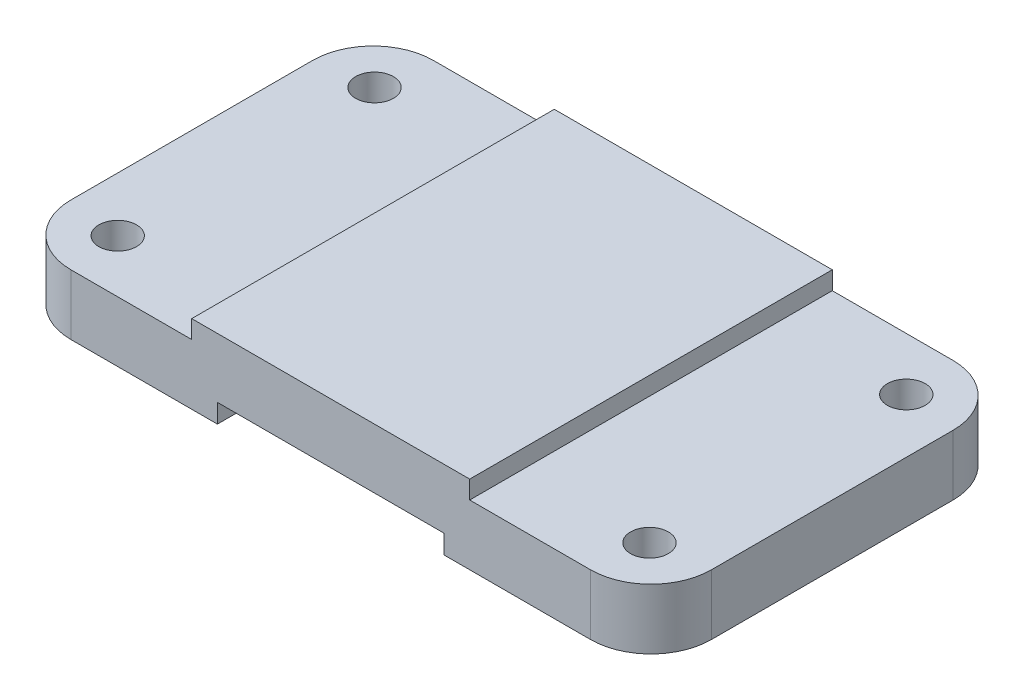
ISO-10303-21;
HEADER;
FILE_DESCRIPTION(('STEP AP214'),'2;1');
FILE_NAME('part.step','',(''),(''),'','','');
FILE_SCHEMA(('AUTOMOTIVE_DESIGN { 1 0 10303 214 1 1 1 1 }'));
ENDSEC;
DATA;
#1=APPLICATION_CONTEXT('core data for automotive mechanical design processes');
#2=APPLICATION_PROTOCOL_DEFINITION('international standard','automotive_design',2000,#1);
#3=PRODUCT_CONTEXT('',#1,'mechanical');
#4=PRODUCT('Part','Part','',(#3));
#5=PRODUCT_RELATED_PRODUCT_CATEGORY('part','',(#4));
#6=PRODUCT_DEFINITION_FORMATION('','',#4);
#7=PRODUCT_DEFINITION_CONTEXT('part definition',#1,'design');
#8=PRODUCT_DEFINITION('design','',#6,#7);
#9=PRODUCT_DEFINITION_SHAPE('','',#8);
#10=(LENGTH_UNIT() NAMED_UNIT(*) SI_UNIT(.MILLI.,.METRE.));
#11=(NAMED_UNIT(*) PLANE_ANGLE_UNIT() SI_UNIT($,.RADIAN.));
#12=(NAMED_UNIT(*) SI_UNIT($,.STERADIAN.) SOLID_ANGLE_UNIT());
#13=UNCERTAINTY_MEASURE_WITH_UNIT(LENGTH_MEASURE(1.E-05),#10,'distance_accuracy_value','');
#14=(GEOMETRIC_REPRESENTATION_CONTEXT(3) GLOBAL_UNCERTAINTY_ASSIGNED_CONTEXT((#13)) GLOBAL_UNIT_ASSIGNED_CONTEXT((#10,
#11,#12)) REPRESENTATION_CONTEXT('',''));
#15=CARTESIAN_POINT('',(0.,0.,0.));
#16=DIRECTION('',(0.,0.,1.));
#17=DIRECTION('',(1.,0.,0.));
#18=AXIS2_PLACEMENT_3D('',#15,#16,#17);
#19=CARTESIAN_POINT('',(12.7,-12.7,-63.5));
#20=DIRECTION('',(0.,1.,0.));
#21=DIRECTION('',(0.,0.,1.));
#22=AXIS2_PLACEMENT_3D('',#19,#20,#21);
#23=PLANE('',#22);
#24=CARTESIAN_POINT('',(11.43,-12.7,-65.0875));
#25=DIRECTION('',(0.,1.,0.));
#26=DIRECTION('',(0.,0.,1.));
#27=AXIS2_PLACEMENT_3D('',#24,#25,#26);
#28=CIRCLE('',#27,3.96875);
#29=CARTESIAN_POINT('',(11.43,-12.7,-61.11875));
#30=VERTEX_POINT('',#29);
#31=EDGE_CURVE('E232',#30,#30,#28,.T.);
#32=ORIENTED_EDGE('',*,*,#31,.T.);
#33=EDGE_LOOP('',(#32));
#34=FACE_BOUND('',#33,.T.);
#35=CARTESIAN_POINT('',(11.43,-12.7,-11.1125));
#36=DIRECTION('',(0.,1.,0.));
#37=DIRECTION('',(0.,0.,1.));
#38=AXIS2_PLACEMENT_3D('',#35,#36,#37);
#39=CIRCLE('',#38,3.96875);
#40=CARTESIAN_POINT('',(11.43,-12.7,-7.14374999999999));
#41=VERTEX_POINT('',#40);
#42=EDGE_CURVE('E214',#41,#41,#39,.T.);
#43=ORIENTED_EDGE('',*,*,#42,.T.);
#44=EDGE_LOOP('',(#43));
#45=FACE_BOUND('',#44,.T.);
#46=DIRECTION('',(-1.,0.,0.));
#47=VECTOR('',#46,1.);
#48=CARTESIAN_POINT('',(12.7000000000001,-12.7,-76.2));
#49=LINE('',#48,#47);
#50=CARTESIAN_POINT('',(43.4975,-12.7,-76.2));
#51=VERTEX_POINT('',#50);
#52=CARTESIAN_POINT('',(12.7000000000001,-12.7,-76.2));
#53=VERTEX_POINT('',#52);
#54=EDGE_CURVE('E261',#51,#53,#49,.T.);
#55=ORIENTED_EDGE('',*,*,#54,.F.);
#56=DIRECTION('',(0.,0.,-1.));
#57=VECTOR('',#56,1.);
#58=CARTESIAN_POINT('',(43.4975,-12.7,0.));
#59=LINE('',#58,#57);
#60=CARTESIAN_POINT('',(43.4975,-12.7,0.));
#61=VERTEX_POINT('',#60);
#62=EDGE_CURVE('E158',#61,#51,#59,.T.);
#63=ORIENTED_EDGE('',*,*,#62,.F.);
#64=DIRECTION('',(1.,0.,0.));
#65=VECTOR('',#64,1.);
#66=CARTESIAN_POINT('',(12.7000000000001,-12.7,0.));
#67=LINE('',#66,#65);
#68=CARTESIAN_POINT('',(12.7000000000001,-12.7,0.));
#69=VERTEX_POINT('',#68);
#70=EDGE_CURVE('E249',#69,#61,#67,.T.);
#71=ORIENTED_EDGE('',*,*,#70,.F.);
#72=CARTESIAN_POINT('',(12.7,-12.7,-12.7));
#73=DIRECTION('',(0.,1.,0.));
#74=DIRECTION('',(0.,0.,1.));
#75=AXIS2_PLACEMENT_3D('',#72,#73,#74);
#76=CIRCLE('',#75,12.7);
#77=CARTESIAN_POINT('',(0.,-12.7,-12.7000000000001));
#78=VERTEX_POINT('',#77);
#79=EDGE_CURVE('E245',#78,#69,#76,.T.);
#80=ORIENTED_EDGE('',*,*,#79,.F.);
#81=DIRECTION('',(0.,0.,1.));
#82=VECTOR('',#81,1.);
#83=CARTESIAN_POINT('',(0.,-12.7,-63.4999999999999));
#84=LINE('',#83,#82);
#85=CARTESIAN_POINT('',(0.,-12.7,-63.4999999999999));
#86=VERTEX_POINT('',#85);
#87=EDGE_CURVE('E241',#86,#78,#84,.T.);
#88=ORIENTED_EDGE('',*,*,#87,.F.);
#89=CARTESIAN_POINT('',(12.7,-12.7,-63.5));
#90=DIRECTION('',(0.,1.,0.));
#91=DIRECTION('',(0.,0.,1.));
#92=AXIS2_PLACEMENT_3D('',#89,#90,#91);
#93=CIRCLE('',#92,12.7);
#94=EDGE_CURVE('E238',#53,#86,#93,.T.);
#95=ORIENTED_EDGE('',*,*,#94,.F.);
#96=EDGE_LOOP('',(#55,#63,#71,#80,#88,#95));
#97=FACE_BOUND('',#96,.T.);
#98=ADVANCED_FACE('F38',(#34,#45,#97),#23,.F.);
#99=CARTESIAN_POINT('',(12.7,0.,-63.5));
#100=DIRECTION('',(0.,1.,0.));
#101=DIRECTION('',(0.,0.,1.));
#102=AXIS2_PLACEMENT_3D('',#99,#100,#101);
#103=PLANE('',#102);
#104=DIRECTION('',(0.,0.,1.));
#105=VECTOR('',#104,1.);
#106=CARTESIAN_POINT('',(38.1,0.,-76.2));
#107=LINE('',#106,#105);
#108=CARTESIAN_POINT('',(38.1,0.,-76.2));
#109=VERTEX_POINT('',#108);
#110=CARTESIAN_POINT('',(38.1,0.,0.));
#111=VERTEX_POINT('',#110);
#112=EDGE_CURVE('E63',#109,#111,#107,.T.);
#113=ORIENTED_EDGE('',*,*,#112,.F.);
#114=DIRECTION('',(-1.,0.,0.));
#115=VECTOR('',#114,1.);
#116=CARTESIAN_POINT('',(12.7000000000001,0.,-76.2));
#117=LINE('',#116,#115);
#118=CARTESIAN_POINT('',(12.7000000000001,0.,-76.2));
#119=VERTEX_POINT('',#118);
#120=EDGE_CURVE('E284',#109,#119,#117,.T.);
#121=ORIENTED_EDGE('',*,*,#120,.T.);
#122=CARTESIAN_POINT('',(12.7,0.,-63.5));
#123=DIRECTION('',(0.,1.,0.));
#124=DIRECTION('',(0.,0.,1.));
#125=AXIS2_PLACEMENT_3D('',#122,#123,#124);
#126=CIRCLE('',#125,12.7);
#127=CARTESIAN_POINT('',(0.,0.,-63.4999999999999));
#128=VERTEX_POINT('',#127);
#129=EDGE_CURVE('E235',#119,#128,#126,.T.);
#130=ORIENTED_EDGE('',*,*,#129,.T.);
#131=DIRECTION('',(0.,0.,1.));
#132=VECTOR('',#131,1.);
#133=CARTESIAN_POINT('',(0.,0.,-63.4999999999999));
#134=LINE('',#133,#132);
#135=CARTESIAN_POINT('',(0.,0.,-12.7000000000001));
#136=VERTEX_POINT('',#135);
#137=EDGE_CURVE('E266',#128,#136,#134,.T.);
#138=ORIENTED_EDGE('',*,*,#137,.T.);
#139=CARTESIAN_POINT('',(12.7,0.,-12.7));
#140=DIRECTION('',(0.,1.,0.));
#141=DIRECTION('',(0.,0.,1.));
#142=AXIS2_PLACEMENT_3D('',#139,#140,#141);
#143=CIRCLE('',#142,12.7);
#144=CARTESIAN_POINT('',(12.7000000000001,0.,0.));
#145=VERTEX_POINT('',#144);
#146=EDGE_CURVE('E269',#136,#145,#143,.T.);
#147=ORIENTED_EDGE('',*,*,#146,.T.);
#148=DIRECTION('',(1.,0.,0.));
#149=VECTOR('',#148,1.);
#150=CARTESIAN_POINT('',(12.7000000000001,0.,0.));
#151=LINE('',#150,#149);
#152=EDGE_CURVE('E273',#145,#111,#151,.T.);
#153=ORIENTED_EDGE('',*,*,#152,.T.);
#154=EDGE_LOOP('',(#113,#121,#130,#138,#147,#153));
#155=FACE_BOUND('',#154,.T.);
#156=CARTESIAN_POINT('',(11.43,0.,-65.0875));
#157=DIRECTION('',(0.,1.,0.));
#158=DIRECTION('',(0.,0.,1.));
#159=AXIS2_PLACEMENT_3D('',#156,#157,#158);
#160=CIRCLE('',#159,3.96875);
#161=CARTESIAN_POINT('',(11.43,0.,-61.11875));
#162=VERTEX_POINT('',#161);
#163=EDGE_CURVE('E229',#162,#162,#160,.T.);
#164=ORIENTED_EDGE('',*,*,#163,.F.);
#165=EDGE_LOOP('',(#164));
#166=FACE_BOUND('',#165,.T.);
#167=CARTESIAN_POINT('',(11.43,0.,-11.1125));
#168=DIRECTION('',(0.,1.,0.));
#169=DIRECTION('',(0.,0.,1.));
#170=AXIS2_PLACEMENT_3D('',#167,#168,#169);
#171=CIRCLE('',#170,3.96875);
#172=CARTESIAN_POINT('',(11.43,0.,-7.14374999999999));
#173=VERTEX_POINT('',#172);
#174=EDGE_CURVE('E213',#173,#173,#171,.T.);
#175=ORIENTED_EDGE('',*,*,#174,.F.);
#176=EDGE_LOOP('',(#175));
#177=FACE_BOUND('',#176,.T.);
#178=ADVANCED_FACE('F305',(#155,#166,#177),#103,.T.);
#179=CARTESIAN_POINT('',(12.7,-12.7,-63.5));
#180=DIRECTION('',(0.,1.,0.));
#181=DIRECTION('',(0.,0.,1.));
#182=AXIS2_PLACEMENT_3D('',#179,#180,#181);
#183=CYLINDRICAL_SURFACE('',#182,12.7);
#184=ORIENTED_EDGE('',*,*,#129,.F.);
#185=DIRECTION('',(0.,1.,0.));
#186=VECTOR('',#185,1.);
#187=CARTESIAN_POINT('',(12.7000000000001,-12.7,-76.2));
#188=LINE('',#187,#186);
#189=EDGE_CURVE('E11',#53,#119,#188,.T.);
#190=ORIENTED_EDGE('',*,*,#189,.F.);
#191=ORIENTED_EDGE('',*,*,#94,.T.);
#192=DIRECTION('',(0.,1.,0.));
#193=VECTOR('',#192,1.);
#194=CARTESIAN_POINT('',(0.,-12.7,-63.4999999999999));
#195=LINE('',#194,#193);
#196=EDGE_CURVE('E42',#86,#128,#195,.T.);
#197=ORIENTED_EDGE('',*,*,#196,.T.);
#198=EDGE_LOOP('',(#184,#190,#191,#197));
#199=FACE_BOUND('',#198,.T.);
#200=ADVANCED_FACE('F40',(#199),#183,.T.);
#201=CARTESIAN_POINT('',(12.7000000000001,-12.7,-76.2));
#202=DIRECTION('',(0.,0.,-1.));
#203=DIRECTION('',(-1.,0.,0.));
#204=AXIS2_PLACEMENT_3D('',#201,#202,#203);
#205=PLANE('',#204);
#206=DIRECTION('',(0.,-1.,0.));
#207=VECTOR('',#206,1.);
#208=CARTESIAN_POINT('',(43.4975,-8.7376,-76.2));
#209=LINE('',#208,#207);
#210=CARTESIAN_POINT('',(43.4975,-8.7376,-76.2));
#211=VERTEX_POINT('',#210);
#212=EDGE_CURVE('E152',#211,#51,#209,.T.);
#213=ORIENTED_EDGE('',*,*,#212,.T.);
#214=ORIENTED_EDGE('',*,*,#54,.T.);
#215=ORIENTED_EDGE('',*,*,#189,.T.);
#216=ORIENTED_EDGE('',*,*,#120,.F.);
#217=DIRECTION('',(0.,-1.,0.));
#218=VECTOR('',#217,1.);
#219=CARTESIAN_POINT('',(38.1,3.80999999999999,-76.2));
#220=LINE('',#219,#218);
#221=CARTESIAN_POINT('',(38.1,3.80999999999999,-76.2));
#222=VERTEX_POINT('',#221);
#223=EDGE_CURVE('E198',#222,#109,#220,.T.);
#224=ORIENTED_EDGE('',*,*,#223,.F.);
#225=DIRECTION('',(-1.,0.,0.));
#226=VECTOR('',#225,1.);
#227=CARTESIAN_POINT('',(38.1,3.80999999999999,-76.2));
#228=LINE('',#227,#226);
#229=CARTESIAN_POINT('',(96.52,3.80999999999999,-76.2));
#230=VERTEX_POINT('',#229);
#231=EDGE_CURVE('E196',#230,#222,#228,.T.);
#232=ORIENTED_EDGE('',*,*,#231,.F.);
#233=DIRECTION('',(0.,-1.,0.));
#234=VECTOR('',#233,1.);
#235=CARTESIAN_POINT('',(96.52,3.80999999999999,-76.2));
#236=LINE('',#235,#234);
#237=CARTESIAN_POINT('',(96.52,0.,-76.2));
#238=VERTEX_POINT('',#237);
#239=EDGE_CURVE('E204',#230,#238,#236,.T.);
#240=ORIENTED_EDGE('',*,*,#239,.T.);
#241=CARTESIAN_POINT('',(121.92,0.,-76.2));
#242=VERTEX_POINT('',#241);
#243=EDGE_CURVE('E242',#242,#238,#117,.T.);
#244=ORIENTED_EDGE('',*,*,#243,.F.);
#245=DIRECTION('',(0.,1.,0.));
#246=VECTOR('',#245,1.);
#247=CARTESIAN_POINT('',(121.92,-12.7,-76.2));
#248=LINE('',#247,#246);
#249=CARTESIAN_POINT('',(121.92,-12.7,-76.2));
#250=VERTEX_POINT('',#249);
#251=EDGE_CURVE('E47',#250,#242,#248,.T.);
#252=ORIENTED_EDGE('',*,*,#251,.F.);
#253=CARTESIAN_POINT('',(91.1225,-12.7,-76.2));
#254=VERTEX_POINT('',#253);
#255=EDGE_CURVE('E262',#250,#254,#49,.T.);
#256=ORIENTED_EDGE('',*,*,#255,.T.);
#257=DIRECTION('',(0.,-1.,0.));
#258=VECTOR('',#257,1.);
#259=CARTESIAN_POINT('',(91.1225,-8.7376,-76.2));
#260=LINE('',#259,#258);
#261=CARTESIAN_POINT('',(91.1225,-8.7376,-76.2));
#262=VERTEX_POINT('',#261);
#263=EDGE_CURVE('E55',#262,#254,#260,.T.);
#264=ORIENTED_EDGE('',*,*,#263,.F.);
#265=DIRECTION('',(1.,0.,0.));
#266=VECTOR('',#265,1.);
#267=CARTESIAN_POINT('',(43.4975,-8.7376,-76.2));
#268=LINE('',#267,#266);
#269=EDGE_CURVE('E168',#211,#262,#268,.T.);
#270=ORIENTED_EDGE('',*,*,#269,.F.);
#271=EDGE_LOOP('',(#213,#214,#215,#216,#224,#232,#240,#244,#252,#256,#264,#270));
#272=FACE_BOUND('',#271,.T.);
#273=ADVANCED_FACE('F173',(#272),#205,.T.);
#274=CARTESIAN_POINT('',(121.92,-12.7,-63.5));
#275=DIRECTION('',(0.,1.,0.));
#276=DIRECTION('',(0.,0.,1.));
#277=AXIS2_PLACEMENT_3D('',#274,#275,#276);
#278=CYLINDRICAL_SURFACE('',#277,12.7);
#279=CARTESIAN_POINT('',(121.92,0.,-63.5));
#280=DIRECTION('',(0.,1.,0.));
#281=DIRECTION('',(0.,0.,1.));
#282=AXIS2_PLACEMENT_3D('',#279,#280,#281);
#283=CIRCLE('',#282,12.7);
#284=CARTESIAN_POINT('',(134.62,0.,-63.4999999999999));
#285=VERTEX_POINT('',#284);
#286=EDGE_CURVE('E281',#285,#242,#283,.T.);
#287=ORIENTED_EDGE('',*,*,#286,.F.);
#288=DIRECTION('',(0.,1.,0.));
#289=VECTOR('',#288,1.);
#290=CARTESIAN_POINT('',(134.62,-12.7,-63.4999999999999));
#291=LINE('',#290,#289);
#292=CARTESIAN_POINT('',(134.62,-12.7,-63.4999999999999));
#293=VERTEX_POINT('',#292);
#294=EDGE_CURVE('E287',#293,#285,#291,.T.);
#295=ORIENTED_EDGE('',*,*,#294,.F.);
#296=CARTESIAN_POINT('',(121.92,-12.7,-63.5));
#297=DIRECTION('',(0.,1.,0.));
#298=DIRECTION('',(0.,0.,1.));
#299=AXIS2_PLACEMENT_3D('',#296,#297,#298);
#300=CIRCLE('',#299,12.7);
#301=EDGE_CURVE('E258',#293,#250,#300,.T.);
#302=ORIENTED_EDGE('',*,*,#301,.T.);
#303=ORIENTED_EDGE('',*,*,#251,.T.);
#304=EDGE_LOOP('',(#287,#295,#302,#303));
#305=FACE_BOUND('',#304,.T.);
#306=ADVANCED_FACE('F346',(#305),#278,.T.);
#307=CARTESIAN_POINT('',(134.62,-12.7,-63.4999999999999));
#308=DIRECTION('',(1.,0.,0.));
#309=DIRECTION('',(0.,0.,-1.));
#310=AXIS2_PLACEMENT_3D('',#307,#308,#309);
#311=PLANE('',#310);
#312=DIRECTION('',(0.,0.,-1.));
#313=VECTOR('',#312,1.);
#314=CARTESIAN_POINT('',(134.62,0.,-63.4999999999999));
#315=LINE('',#314,#313);
#316=CARTESIAN_POINT('',(134.62,0.,-12.7000000000001));
#317=VERTEX_POINT('',#316);
#318=EDGE_CURVE('E278',#317,#285,#315,.T.);
#319=ORIENTED_EDGE('',*,*,#318,.F.);
#320=DIRECTION('',(0.,1.,0.));
#321=VECTOR('',#320,1.);
#322=CARTESIAN_POINT('',(134.62,-12.7,-12.7000000000001));
#323=LINE('',#322,#321);
#324=CARTESIAN_POINT('',(134.62,-12.7,-12.7000000000001));
#325=VERTEX_POINT('',#324);
#326=EDGE_CURVE('E289',#325,#317,#323,.T.);
#327=ORIENTED_EDGE('',*,*,#326,.F.);
#328=DIRECTION('',(0.,0.,-1.));
#329=VECTOR('',#328,1.);
#330=CARTESIAN_POINT('',(134.62,-12.7,-63.4999999999999));
#331=LINE('',#330,#329);
#332=EDGE_CURVE('E255',#325,#293,#331,.T.);
#333=ORIENTED_EDGE('',*,*,#332,.T.);
#334=ORIENTED_EDGE('',*,*,#294,.T.);
#335=EDGE_LOOP('',(#319,#327,#333,#334));
#336=FACE_BOUND('',#335,.T.);
#337=ADVANCED_FACE('F342',(#336),#311,.T.);
#338=CARTESIAN_POINT('',(121.92,-12.7,-12.7));
#339=DIRECTION('',(0.,1.,0.));
#340=DIRECTION('',(0.,0.,1.));
#341=AXIS2_PLACEMENT_3D('',#338,#339,#340);
#342=CYLINDRICAL_SURFACE('',#341,12.7);
#343=CARTESIAN_POINT('',(121.92,0.,-12.7));
#344=DIRECTION('',(0.,1.,0.));
#345=DIRECTION('',(0.,0.,1.));
#346=AXIS2_PLACEMENT_3D('',#343,#344,#345);
#347=CIRCLE('',#346,12.7);
#348=CARTESIAN_POINT('',(121.92,0.,0.));
#349=VERTEX_POINT('',#348);
#350=EDGE_CURVE('E275',#349,#317,#347,.T.);
#351=ORIENTED_EDGE('',*,*,#350,.F.);
#352=DIRECTION('',(0.,1.,0.));
#353=VECTOR('',#352,1.);
#354=CARTESIAN_POINT('',(121.92,-12.7,0.));
#355=LINE('',#354,#353);
#356=CARTESIAN_POINT('',(121.92,-12.7,0.));
#357=VERTEX_POINT('',#356);
#358=EDGE_CURVE('E291',#357,#349,#355,.T.);
#359=ORIENTED_EDGE('',*,*,#358,.F.);
#360=CARTESIAN_POINT('',(121.92,-12.7,-12.7));
#361=DIRECTION('',(0.,1.,0.));
#362=DIRECTION('',(0.,0.,1.));
#363=AXIS2_PLACEMENT_3D('',#360,#361,#362);
#364=CIRCLE('',#363,12.7);
#365=EDGE_CURVE('E252',#357,#325,#364,.T.);
#366=ORIENTED_EDGE('',*,*,#365,.T.);
#367=ORIENTED_EDGE('',*,*,#326,.T.);
#368=EDGE_LOOP('',(#351,#359,#366,#367));
#369=FACE_BOUND('',#368,.T.);
#370=ADVANCED_FACE('F338',(#369),#342,.T.);
#371=CARTESIAN_POINT('',(12.7000000000001,-12.7,0.));
#372=DIRECTION('',(0.,0.,1.));
#373=DIRECTION('',(1.,0.,0.));
#374=AXIS2_PLACEMENT_3D('',#371,#372,#373);
#375=PLANE('',#374);
#376=DIRECTION('',(0.,-1.,0.));
#377=VECTOR('',#376,1.);
#378=CARTESIAN_POINT('',(43.4975,-8.7376,0.));
#379=LINE('',#378,#377);
#380=CARTESIAN_POINT('',(43.4975,-8.7376,0.));
#381=VERTEX_POINT('',#380);
#382=EDGE_CURVE('E182',#381,#61,#379,.T.);
#383=ORIENTED_EDGE('',*,*,#382,.F.);
#384=DIRECTION('',(-1.,0.,0.));
#385=VECTOR('',#384,1.);
#386=CARTESIAN_POINT('',(43.4975,-8.7376,0.));
#387=LINE('',#386,#385);
#388=CARTESIAN_POINT('',(91.1225,-8.7376,0.));
#389=VERTEX_POINT('',#388);
#390=EDGE_CURVE('E162',#389,#381,#387,.T.);
#391=ORIENTED_EDGE('',*,*,#390,.F.);
#392=DIRECTION('',(0.,-1.,0.));
#393=VECTOR('',#392,1.);
#394=CARTESIAN_POINT('',(91.1225,-8.7376,0.));
#395=LINE('',#394,#393);
#396=CARTESIAN_POINT('',(91.1225,-12.7,0.));
#397=VERTEX_POINT('',#396);
#398=EDGE_CURVE('E184',#389,#397,#395,.T.);
#399=ORIENTED_EDGE('',*,*,#398,.T.);
#400=EDGE_CURVE('E248',#397,#357,#67,.T.);
#401=ORIENTED_EDGE('',*,*,#400,.T.);
#402=ORIENTED_EDGE('',*,*,#358,.T.);
#403=CARTESIAN_POINT('',(96.52,0.,0.));
#404=VERTEX_POINT('',#403);
#405=EDGE_CURVE('E272',#404,#349,#151,.T.);
#406=ORIENTED_EDGE('',*,*,#405,.F.);
#407=DIRECTION('',(0.,-1.,0.));
#408=VECTOR('',#407,1.);
#409=CARTESIAN_POINT('',(96.52,3.80999999999999,0.));
#410=LINE('',#409,#408);
#411=CARTESIAN_POINT('',(96.52,3.80999999999999,0.));
#412=VERTEX_POINT('',#411);
#413=EDGE_CURVE('E207',#412,#404,#410,.T.);
#414=ORIENTED_EDGE('',*,*,#413,.F.);
#415=DIRECTION('',(1.,0.,0.));
#416=VECTOR('',#415,1.);
#417=CARTESIAN_POINT('',(38.1,3.80999999999999,0.));
#418=LINE('',#417,#416);
#419=CARTESIAN_POINT('',(38.1,3.80999999999999,0.));
#420=VERTEX_POINT('',#419);
#421=EDGE_CURVE('E191',#420,#412,#418,.T.);
#422=ORIENTED_EDGE('',*,*,#421,.F.);
#423=DIRECTION('',(0.,-1.,0.));
#424=VECTOR('',#423,1.);
#425=CARTESIAN_POINT('',(38.1,3.80999999999999,0.));
#426=LINE('',#425,#424);
#427=EDGE_CURVE('E210',#420,#111,#426,.T.);
#428=ORIENTED_EDGE('',*,*,#427,.T.);
#429=ORIENTED_EDGE('',*,*,#152,.F.);
#430=DIRECTION('',(0.,1.,0.));
#431=VECTOR('',#430,1.);
#432=CARTESIAN_POINT('',(12.7000000000001,-12.7,0.));
#433=LINE('',#432,#431);
#434=EDGE_CURVE('E294',#69,#145,#433,.T.);
#435=ORIENTED_EDGE('',*,*,#434,.F.);
#436=ORIENTED_EDGE('',*,*,#70,.T.);
#437=EDGE_LOOP('',(#383,#391,#399,#401,#402,#406,#414,#422,#428,#429,#435,#436));
#438=FACE_BOUND('',#437,.T.);
#439=ADVANCED_FACE('F316',(#438),#375,.T.);
#440=CARTESIAN_POINT('',(12.7,-12.7,-12.7));
#441=DIRECTION('',(0.,1.,0.));
#442=DIRECTION('',(0.,0.,1.));
#443=AXIS2_PLACEMENT_3D('',#440,#441,#442);
#444=CYLINDRICAL_SURFACE('',#443,12.7);
#445=ORIENTED_EDGE('',*,*,#146,.F.);
#446=DIRECTION('',(0.,1.,0.));
#447=VECTOR('',#446,1.);
#448=CARTESIAN_POINT('',(0.,-12.7,-12.7000000000001));
#449=LINE('',#448,#447);
#450=EDGE_CURVE('E295',#78,#136,#449,.T.);
#451=ORIENTED_EDGE('',*,*,#450,.F.);
#452=ORIENTED_EDGE('',*,*,#79,.T.);
#453=ORIENTED_EDGE('',*,*,#434,.T.);
#454=EDGE_LOOP('',(#445,#451,#452,#453));
#455=FACE_BOUND('',#454,.T.);
#456=ADVANCED_FACE('F312',(#455),#444,.T.);
#457=CARTESIAN_POINT('',(0.,-12.7,-63.4999999999999));
#458=DIRECTION('',(-1.,0.,0.));
#459=DIRECTION('',(0.,0.,1.));
#460=AXIS2_PLACEMENT_3D('',#457,#458,#459);
#461=PLANE('',#460);
#462=ORIENTED_EDGE('',*,*,#137,.F.);
#463=ORIENTED_EDGE('',*,*,#196,.F.);
#464=ORIENTED_EDGE('',*,*,#87,.T.);
#465=ORIENTED_EDGE('',*,*,#450,.T.);
#466=EDGE_LOOP('',(#462,#463,#464,#465));
#467=FACE_BOUND('',#466,.T.);
#468=ADVANCED_FACE('F304',(#467),#461,.T.);
#469=CARTESIAN_POINT('',(123.19,-12.7,-11.1125));
#470=DIRECTION('',(0.,1.,0.));
#471=DIRECTION('',(0.,0.,1.));
#472=AXIS2_PLACEMENT_3D('',#469,#470,#471);
#473=CIRCLE('',#472,3.96874999999995);
#474=CARTESIAN_POINT('',(123.19,-12.7,-7.14375000000006));
#475=VERTEX_POINT('',#474);
#476=EDGE_CURVE('E220',#475,#475,#473,.T.);
#477=ORIENTED_EDGE('',*,*,#476,.T.);
#478=EDGE_LOOP('',(#477));
#479=FACE_BOUND('',#478,.T.);
#480=CARTESIAN_POINT('',(123.19,-12.7,-65.0875));
#481=DIRECTION('',(0.,1.,0.));
#482=DIRECTION('',(0.,0.,1.));
#483=AXIS2_PLACEMENT_3D('',#480,#481,#482);
#484=CIRCLE('',#483,3.96874999999996);
#485=CARTESIAN_POINT('',(123.19,-12.7,-61.11875));
#486=VERTEX_POINT('',#485);
#487=EDGE_CURVE('E226',#486,#486,#484,.T.);
#488=ORIENTED_EDGE('',*,*,#487,.T.);
#489=EDGE_LOOP('',(#488));
#490=FACE_BOUND('',#489,.T.);
#491=ORIENTED_EDGE('',*,*,#400,.F.);
#492=DIRECTION('',(0.,0.,1.));
#493=VECTOR('',#492,1.);
#494=CARTESIAN_POINT('',(91.1225,-12.7,0.));
#495=LINE('',#494,#493);
#496=EDGE_CURVE('E171',#254,#397,#495,.T.);
#497=ORIENTED_EDGE('',*,*,#496,.F.);
#498=ORIENTED_EDGE('',*,*,#255,.F.);
#499=ORIENTED_EDGE('',*,*,#301,.F.);
#500=ORIENTED_EDGE('',*,*,#332,.F.);
#501=ORIENTED_EDGE('',*,*,#365,.F.);
#502=EDGE_LOOP('',(#491,#497,#498,#499,#500,#501));
#503=FACE_BOUND('',#502,.T.);
#504=ADVANCED_FACE('F349',(#479,#490,#503),#23,.F.);
#505=DIRECTION('',(0.,0.,-1.));
#506=VECTOR('',#505,1.);
#507=CARTESIAN_POINT('',(96.52,0.,-76.2));
#508=LINE('',#507,#506);
#509=EDGE_CURVE('E192',#404,#238,#508,.T.);
#510=ORIENTED_EDGE('',*,*,#509,.F.);
#511=ORIENTED_EDGE('',*,*,#405,.T.);
#512=ORIENTED_EDGE('',*,*,#350,.T.);
#513=ORIENTED_EDGE('',*,*,#318,.T.);
#514=ORIENTED_EDGE('',*,*,#286,.T.);
#515=ORIENTED_EDGE('',*,*,#243,.T.);
#516=EDGE_LOOP('',(#510,#511,#512,#513,#514,#515));
#517=FACE_BOUND('',#516,.T.);
#518=CARTESIAN_POINT('',(123.19,0.,-11.1125));
#519=DIRECTION('',(0.,1.,0.));
#520=DIRECTION('',(0.,0.,1.));
#521=AXIS2_PLACEMENT_3D('',#518,#519,#520);
#522=CIRCLE('',#521,3.96874999999995);
#523=CARTESIAN_POINT('',(123.19,0.,-7.14375000000006));
#524=VERTEX_POINT('',#523);
#525=EDGE_CURVE('E217',#524,#524,#522,.T.);
#526=ORIENTED_EDGE('',*,*,#525,.F.);
#527=EDGE_LOOP('',(#526));
#528=FACE_BOUND('',#527,.T.);
#529=CARTESIAN_POINT('',(123.19,0.,-65.0875));
#530=DIRECTION('',(0.,1.,0.));
#531=DIRECTION('',(0.,0.,1.));
#532=AXIS2_PLACEMENT_3D('',#529,#530,#531);
#533=CIRCLE('',#532,3.96874999999996);
#534=CARTESIAN_POINT('',(123.19,0.,-61.11875));
#535=VERTEX_POINT('',#534);
#536=EDGE_CURVE('E223',#535,#535,#533,.T.);
#537=ORIENTED_EDGE('',*,*,#536,.F.);
#538=EDGE_LOOP('',(#537));
#539=FACE_BOUND('',#538,.T.);
#540=ADVANCED_FACE('F331',(#517,#528,#539),#103,.T.);
#541=CARTESIAN_POINT('',(11.43,-12.7,-65.0875));
#542=DIRECTION('',(0.,1.,0.));
#543=DIRECTION('',(0.,0.,1.));
#544=AXIS2_PLACEMENT_3D('',#541,#542,#543);
#545=CYLINDRICAL_SURFACE('',#544,3.96875);
#546=ORIENTED_EDGE('',*,*,#31,.F.);
#547=EDGE_LOOP('',(#546));
#548=FACE_BOUND('',#547,.T.);
#549=ORIENTED_EDGE('',*,*,#163,.T.);
#550=EDGE_LOOP('',(#549));
#551=FACE_BOUND('',#550,.T.);
#552=ADVANCED_FACE('F374',(#548,#551),#545,.F.);
#553=CARTESIAN_POINT('',(123.19,-12.7,-65.0875));
#554=DIRECTION('',(0.,1.,0.));
#555=DIRECTION('',(0.,0.,1.));
#556=AXIS2_PLACEMENT_3D('',#553,#554,#555);
#557=CYLINDRICAL_SURFACE('',#556,3.96874999999996);
#558=ORIENTED_EDGE('',*,*,#487,.F.);
#559=EDGE_LOOP('',(#558));
#560=FACE_BOUND('',#559,.T.);
#561=ORIENTED_EDGE('',*,*,#536,.T.);
#562=EDGE_LOOP('',(#561));
#563=FACE_BOUND('',#562,.T.);
#564=ADVANCED_FACE('F379',(#560,#563),#557,.F.);
#565=CARTESIAN_POINT('',(123.19,-12.7,-11.1125));
#566=DIRECTION('',(0.,1.,0.));
#567=DIRECTION('',(0.,0.,1.));
#568=AXIS2_PLACEMENT_3D('',#565,#566,#567);
#569=CYLINDRICAL_SURFACE('',#568,3.96874999999995);
#570=ORIENTED_EDGE('',*,*,#476,.F.);
#571=EDGE_LOOP('',(#570));
#572=FACE_BOUND('',#571,.T.);
#573=ORIENTED_EDGE('',*,*,#525,.T.);
#574=EDGE_LOOP('',(#573));
#575=FACE_BOUND('',#574,.T.);
#576=ADVANCED_FACE('F382',(#572,#575),#569,.F.);
#577=CARTESIAN_POINT('',(11.43,-12.7,-11.1125));
#578=DIRECTION('',(0.,1.,0.));
#579=DIRECTION('',(0.,0.,1.));
#580=AXIS2_PLACEMENT_3D('',#577,#578,#579);
#581=CYLINDRICAL_SURFACE('',#580,3.96875);
#582=ORIENTED_EDGE('',*,*,#42,.F.);
#583=EDGE_LOOP('',(#582));
#584=FACE_BOUND('',#583,.T.);
#585=ORIENTED_EDGE('',*,*,#174,.T.);
#586=EDGE_LOOP('',(#585));
#587=FACE_BOUND('',#586,.T.);
#588=ADVANCED_FACE('F390',(#584,#587),#581,.F.);
#589=CARTESIAN_POINT('',(38.1,3.80999999999999,-76.2));
#590=DIRECTION('',(1.,0.,0.));
#591=DIRECTION('',(0.,0.,-1.));
#592=AXIS2_PLACEMENT_3D('',#589,#590,#591);
#593=PLANE('',#592);
#594=ORIENTED_EDGE('',*,*,#112,.T.);
#595=ORIENTED_EDGE('',*,*,#427,.F.);
#596=DIRECTION('',(0.,0.,1.));
#597=VECTOR('',#596,1.);
#598=CARTESIAN_POINT('',(38.1,3.80999999999999,-76.2));
#599=LINE('',#598,#597);
#600=EDGE_CURVE('E188',#222,#420,#599,.T.);
#601=ORIENTED_EDGE('',*,*,#600,.F.);
#602=ORIENTED_EDGE('',*,*,#223,.T.);
#603=EDGE_LOOP('',(#594,#595,#601,#602));
#604=FACE_BOUND('',#603,.T.);
#605=ADVANCED_FACE('F320',(#604),#593,.F.);
#606=CARTESIAN_POINT('',(96.52,3.80999999999999,-76.2));
#607=DIRECTION('',(-1.,0.,0.));
#608=DIRECTION('',(0.,0.,1.));
#609=AXIS2_PLACEMENT_3D('',#606,#607,#608);
#610=PLANE('',#609);
#611=ORIENTED_EDGE('',*,*,#509,.T.);
#612=ORIENTED_EDGE('',*,*,#239,.F.);
#613=DIRECTION('',(0.,0.,-1.));
#614=VECTOR('',#613,1.);
#615=CARTESIAN_POINT('',(96.52,3.80999999999999,-76.2));
#616=LINE('',#615,#614);
#617=EDGE_CURVE('E194',#412,#230,#616,.T.);
#618=ORIENTED_EDGE('',*,*,#617,.F.);
#619=ORIENTED_EDGE('',*,*,#413,.T.);
#620=EDGE_LOOP('',(#611,#612,#618,#619));
#621=FACE_BOUND('',#620,.T.);
#622=ADVANCED_FACE('F328',(#621),#610,.F.);
#623=CARTESIAN_POINT('',(0.,3.80999999999999,0.));
#624=DIRECTION('',(0.,1.,0.));
#625=DIRECTION('',(0.,0.,1.));
#626=AXIS2_PLACEMENT_3D('',#623,#624,#625);
#627=PLANE('',#626);
#628=ORIENTED_EDGE('',*,*,#600,.T.);
#629=ORIENTED_EDGE('',*,*,#421,.T.);
#630=ORIENTED_EDGE('',*,*,#617,.T.);
#631=ORIENTED_EDGE('',*,*,#231,.T.);
#632=EDGE_LOOP('',(#628,#629,#630,#631));
#633=FACE_BOUND('',#632,.T.);
#634=ADVANCED_FACE('F325',(#633),#627,.T.);
#635=CARTESIAN_POINT('',(43.4975,-8.7376,0.));
#636=DIRECTION('',(-1.,0.,0.));
#637=DIRECTION('',(0.,0.,1.));
#638=AXIS2_PLACEMENT_3D('',#635,#636,#637);
#639=PLANE('',#638);
#640=ORIENTED_EDGE('',*,*,#62,.T.);
#641=ORIENTED_EDGE('',*,*,#212,.F.);
#642=DIRECTION('',(0.,0.,-1.));
#643=VECTOR('',#642,1.);
#644=CARTESIAN_POINT('',(43.4975,-8.7376,0.));
#645=LINE('',#644,#643);
#646=EDGE_CURVE('E155',#381,#211,#645,.T.);
#647=ORIENTED_EDGE('',*,*,#646,.F.);
#648=ORIENTED_EDGE('',*,*,#382,.T.);
#649=EDGE_LOOP('',(#640,#641,#647,#648));
#650=FACE_BOUND('',#649,.T.);
#651=ADVANCED_FACE('F154',(#650),#639,.F.);
#652=CARTESIAN_POINT('',(91.1225,-8.7376,0.));
#653=DIRECTION('',(1.,0.,0.));
#654=DIRECTION('',(0.,0.,-1.));
#655=AXIS2_PLACEMENT_3D('',#652,#653,#654);
#656=PLANE('',#655);
#657=ORIENTED_EDGE('',*,*,#496,.T.);
#658=ORIENTED_EDGE('',*,*,#398,.F.);
#659=DIRECTION('',(0.,0.,1.));
#660=VECTOR('',#659,1.);
#661=CARTESIAN_POINT('',(91.1225,-8.7376,0.));
#662=LINE('',#661,#660);
#663=EDGE_CURVE('E175',#262,#389,#662,.T.);
#664=ORIENTED_EDGE('',*,*,#663,.F.);
#665=ORIENTED_EDGE('',*,*,#263,.T.);
#666=EDGE_LOOP('',(#657,#658,#664,#665));
#667=FACE_BOUND('',#666,.T.);
#668=ADVANCED_FACE('F350',(#667),#656,.F.);
#669=CARTESIAN_POINT('',(0.,-8.7376,0.));
#670=DIRECTION('',(0.,-1.,0.));
#671=DIRECTION('',(0.,0.,-1.));
#672=AXIS2_PLACEMENT_3D('',#669,#670,#671);
#673=PLANE('',#672);
#674=ORIENTED_EDGE('',*,*,#646,.T.);
#675=ORIENTED_EDGE('',*,*,#269,.T.);
#676=ORIENTED_EDGE('',*,*,#663,.T.);
#677=ORIENTED_EDGE('',*,*,#390,.T.);
#678=EDGE_LOOP('',(#674,#675,#676,#677));
#679=FACE_BOUND('',#678,.T.);
#680=ADVANCED_FACE('F166',(#679),#673,.T.);
#681=CLOSED_SHELL('',(#98,#178,#200,#273,#306,#337,#370,#439,#456,#468,#504,#540,#552,#564,#576,
#588,#605,#622,#634,#651,#668,#680));
#682=MANIFOLD_SOLID_BREP('B2',#681);
#683=ADVANCED_BREP_SHAPE_REPRESENTATION('',(#18,#682),#14);
#684=SHAPE_DEFINITION_REPRESENTATION(#9,#683);
ENDSEC;
END-ISO-10303-21;
